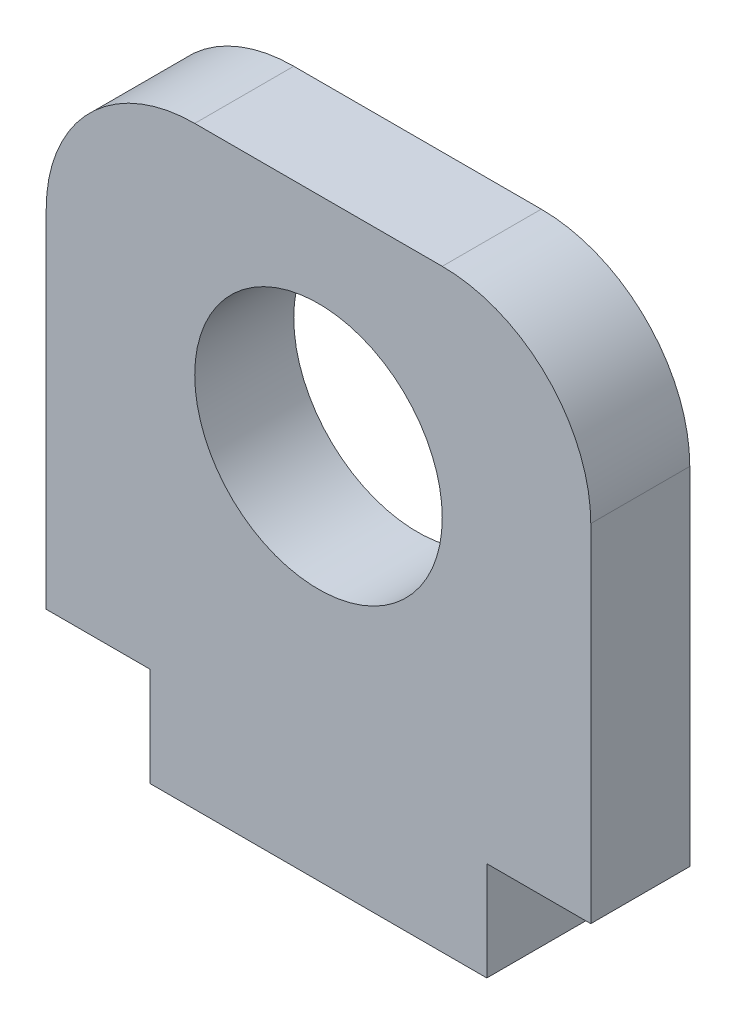
ISO-10303-21;
HEADER;
FILE_DESCRIPTION(('STEP AP214'),'2;1');
FILE_NAME('part.step','',(''),(''),'','','');
FILE_SCHEMA(('AUTOMOTIVE_DESIGN { 1 0 10303 214 1 1 1 1 }'));
ENDSEC;
DATA;
#1=APPLICATION_CONTEXT('core data for automotive mechanical design processes');
#2=APPLICATION_PROTOCOL_DEFINITION('international standard','automotive_design',2000,#1);
#3=PRODUCT_CONTEXT('',#1,'mechanical');
#4=PRODUCT('Part','Part','',(#3));
#5=PRODUCT_RELATED_PRODUCT_CATEGORY('part','',(#4));
#6=PRODUCT_DEFINITION_FORMATION('','',#4);
#7=PRODUCT_DEFINITION_CONTEXT('part definition',#1,'design');
#8=PRODUCT_DEFINITION('design','',#6,#7);
#9=PRODUCT_DEFINITION_SHAPE('','',#8);
#10=(LENGTH_UNIT() NAMED_UNIT(*) SI_UNIT(.MILLI.,.METRE.));
#11=(NAMED_UNIT(*) PLANE_ANGLE_UNIT() SI_UNIT($,.RADIAN.));
#12=(NAMED_UNIT(*) SI_UNIT($,.STERADIAN.) SOLID_ANGLE_UNIT());
#13=UNCERTAINTY_MEASURE_WITH_UNIT(LENGTH_MEASURE(1.E-05),#10,'distance_accuracy_value','');
#14=(GEOMETRIC_REPRESENTATION_CONTEXT(3) GLOBAL_UNCERTAINTY_ASSIGNED_CONTEXT((#13)) GLOBAL_UNIT_ASSIGNED_CONTEXT((#10,
#11,#12)) REPRESENTATION_CONTEXT('',''));
#15=CARTESIAN_POINT('',(0.,0.,0.));
#16=DIRECTION('',(0.,0.,1.));
#17=DIRECTION('',(1.,0.,0.));
#18=AXIS2_PLACEMENT_3D('',#15,#16,#17);
#19=CARTESIAN_POINT('',(-17.0000000000026,-1.99840144432528E-12,5.00000000000456));
#20=DIRECTION('',(-0.999999999999999,0.,0.));
#21=DIRECTION('',(0.,1.00000000000016,0.));
#22=AXIS2_PLACEMENT_3D('',#19,#20,#21);
#23=PLANE('',#22);
#24=DIRECTION('',(0.,0.,1.00000000000016));
#25=VECTOR('',#24,1.);
#26=CARTESIAN_POINT('',(-17.0000000000024,9.99999999999779,5.));
#27=LINE('',#26,#25);
#28=CARTESIAN_POINT('',(-17.0000000000007,10.0000000000021,-4.99999999999945));
#29=VERTEX_POINT('',#28);
#30=CARTESIAN_POINT('',(-17.0000000000024,9.99999999999779,5.));
#31=VERTEX_POINT('',#30);
#32=EDGE_CURVE('E11',#29,#31,#27,.T.);
#33=ORIENTED_EDGE('',*,*,#32,.F.);
#34=DIRECTION('',(0.,1.00000000000016,0.));
#35=VECTOR('',#34,1.);
#36=CARTESIAN_POINT('',(-16.9999999999988,60.0000000000018,-4.99999999999445));
#37=LINE('',#36,#35);
#38=CARTESIAN_POINT('',(-17.0000000000011,1.88737914186277E-12,-4.9999999999949));
#39=VERTEX_POINT('',#38);
#40=EDGE_CURVE('E115',#39,#29,#37,.T.);
#41=ORIENTED_EDGE('',*,*,#40,.F.);
#42=DIRECTION('',(0.,0.,1.00000000000016));
#43=VECTOR('',#42,1.);
#44=CARTESIAN_POINT('',(-17.0000000000026,-1.99840144432528E-12,5.00000000000456));
#45=LINE('',#44,#43);
#46=CARTESIAN_POINT('',(-17.0000000000026,-1.99840144432528E-12,5.00000000000456));
#47=VERTEX_POINT('',#46);
#48=EDGE_CURVE('E51',#39,#47,#45,.T.);
#49=ORIENTED_EDGE('',*,*,#48,.T.);
#50=DIRECTION('',(0.,1.00000000000016,0.));
#51=VECTOR('',#50,1.);
#52=CARTESIAN_POINT('',(-17.0000000000026,-1.99840144432528E-12,5.00000000000456));
#53=LINE('',#52,#51);
#54=EDGE_CURVE('E190',#47,#31,#53,.T.);
#55=ORIENTED_EDGE('',*,*,#54,.T.);
#56=EDGE_LOOP('',(#33,#41,#49,#55));
#57=FACE_BOUND('',#56,.T.);
#58=ADVANCED_FACE('F40',(#57),#23,.T.);
#59=CARTESIAN_POINT('',(-27.500000000002,-1.62092561595273E-11,5.00000000000933));
#60=DIRECTION('',(0.,1.00000000000016,0.));
#61=DIRECTION('',(0.999999999999999,0.,0.));
#62=AXIS2_PLACEMENT_3D('',#59,#60,#61);
#63=PLANE('',#62);
#64=ORIENTED_EDGE('',*,*,#48,.F.);
#65=DIRECTION('',(-0.999999999999999,0.,0.));
#66=VECTOR('',#65,1.);
#67=CARTESIAN_POINT('',(-27.5000000000002,-1.23234755733392E-11,-4.99999999999046));
#68=LINE('',#67,#66);
#69=CARTESIAN_POINT('',(16.9999999999994,1.66533453693773E-12,-5.00000000000322));
#70=VERTEX_POINT('',#69);
#71=EDGE_CURVE('E152',#39,#70,#68,.F.);
#72=ORIENTED_EDGE('',*,*,#71,.T.);
#73=DIRECTION('',(0.,0.,1.00000000000016));
#74=VECTOR('',#73,1.);
#75=CARTESIAN_POINT('',(16.9999999999999,-2.33146835171283E-12,4.99999999999701));
#76=LINE('',#75,#74);
#77=CARTESIAN_POINT('',(16.9999999999999,-2.33146835171283E-12,4.99999999999701));
#78=VERTEX_POINT('',#77);
#79=EDGE_CURVE('E179',#70,#78,#76,.T.);
#80=ORIENTED_EDGE('',*,*,#79,.T.);
#81=DIRECTION('',(0.999999999999999,0.,0.));
#82=VECTOR('',#81,1.);
#83=CARTESIAN_POINT('',(-27.500000000002,-1.62092561595273E-11,5.00000000000933));
#84=LINE('',#83,#82);
#85=EDGE_CURVE('E199',#47,#78,#84,.T.);
#86=ORIENTED_EDGE('',*,*,#85,.F.);
#87=EDGE_LOOP('',(#64,#72,#80,#86));
#88=FACE_BOUND('',#87,.T.);
#89=ADVANCED_FACE('F202',(#88),#63,.F.);
#90=CARTESIAN_POINT('',(16.9999999999999,-2.33146835171283E-12,4.99999999999701));
#91=DIRECTION('',(0.999999999999999,0.,0.));
#92=DIRECTION('',(0.,-1.00000000000016,0.));
#93=AXIS2_PLACEMENT_3D('',#90,#91,#92);
#94=PLANE('',#93);
#95=ORIENTED_EDGE('',*,*,#79,.F.);
#96=DIRECTION('',(0.,1.00000000000016,0.));
#97=VECTOR('',#96,1.);
#98=CARTESIAN_POINT('',(16.9999999999986,60.0000000000019,-5.00000000000278));
#99=LINE('',#98,#97);
#100=CARTESIAN_POINT('',(16.9999999999994,10.0000000000018,-5.));
#101=VERTEX_POINT('',#100);
#102=EDGE_CURVE('E148',#101,#70,#99,.F.);
#103=ORIENTED_EDGE('',*,*,#102,.F.);
#104=DIRECTION('',(0.,0.,1.00000000000016));
#105=VECTOR('',#104,1.);
#106=CARTESIAN_POINT('',(16.9999999999996,9.9999999999979,5.00000000000067));
#107=LINE('',#106,#105);
#108=CARTESIAN_POINT('',(16.9999999999996,9.9999999999979,5.00000000000067));
#109=VERTEX_POINT('',#108);
#110=EDGE_CURVE('E175',#101,#109,#107,.T.);
#111=ORIENTED_EDGE('',*,*,#110,.T.);
#112=DIRECTION('',(0.,-1.00000000000016,0.));
#113=VECTOR('',#112,1.);
#114=CARTESIAN_POINT('',(16.9999999999999,-2.33146835171283E-12,4.99999999999701));
#115=LINE('',#114,#113);
#116=EDGE_CURVE('E204',#109,#78,#115,.T.);
#117=ORIENTED_EDGE('',*,*,#116,.T.);
#118=EDGE_LOOP('',(#95,#103,#111,#117));
#119=FACE_BOUND('',#118,.T.);
#120=ADVANCED_FACE('F259',(#119),#94,.T.);
#121=CARTESIAN_POINT('',(27.4999999999994,9.99999999999768,5.00000000000445));
#122=DIRECTION('',(0.,-1.00000000000016,0.));
#123=DIRECTION('',(-0.999999999999999,0.,0.));
#124=AXIS2_PLACEMENT_3D('',#121,#122,#123);
#125=PLANE('',#124);
#126=ORIENTED_EDGE('',*,*,#110,.F.);
#127=DIRECTION('',(-0.999999999999999,0.,0.));
#128=VECTOR('',#127,1.);
#129=CARTESIAN_POINT('',(-27.5000000000001,9.99999999998824,-4.99999999999023));
#130=LINE('',#129,#128);
#131=CARTESIAN_POINT('',(27.4999999999994,10.0000000000022,-4.99999999999434));
#132=VERTEX_POINT('',#131);
#133=EDGE_CURVE('E144',#132,#101,#130,.T.);
#134=ORIENTED_EDGE('',*,*,#133,.F.);
#135=DIRECTION('',(0.,0.,1.00000000000016));
#136=VECTOR('',#135,1.);
#137=CARTESIAN_POINT('',(27.4999999999994,9.99999999999768,5.00000000000445));
#138=LINE('',#137,#136);
#139=CARTESIAN_POINT('',(27.4999999999994,9.99999999999768,5.00000000000445));
#140=VERTEX_POINT('',#139);
#141=EDGE_CURVE('E171',#132,#140,#138,.T.);
#142=ORIENTED_EDGE('',*,*,#141,.T.);
#143=DIRECTION('',(-0.999999999999999,0.,0.));
#144=VECTOR('',#143,1.);
#145=CARTESIAN_POINT('',(27.4999999999994,9.99999999999768,5.00000000000445));
#146=LINE('',#145,#144);
#147=EDGE_CURVE('E208',#140,#109,#146,.T.);
#148=ORIENTED_EDGE('',*,*,#147,.T.);
#149=EDGE_LOOP('',(#126,#134,#142,#148));
#150=FACE_BOUND('',#149,.T.);
#151=ADVANCED_FACE('F251',(#150),#125,.T.);
#152=CARTESIAN_POINT('',(27.4999999999992,59.9999999999979,5.00000000000045));
#153=DIRECTION('',(0.999999999999999,0.,0.));
#154=DIRECTION('',(0.,-1.00000000000016,0.));
#155=AXIS2_PLACEMENT_3D('',#152,#153,#154);
#156=PLANE('',#155);
#157=ORIENTED_EDGE('',*,*,#141,.F.);
#158=DIRECTION('',(0.,1.00000000000016,0.));
#159=VECTOR('',#158,1.);
#160=CARTESIAN_POINT('',(27.4999999999987,60.0000000000017,-4.99999999999889));
#161=LINE('',#160,#159);
#162=CARTESIAN_POINT('',(27.4999999999996,45.0000000000021,-4.99999999999479));
#163=VERTEX_POINT('',#162);
#164=EDGE_CURVE('E140',#163,#132,#161,.F.);
#165=ORIENTED_EDGE('',*,*,#164,.F.);
#166=DIRECTION('',(0.,0.,1.00000000000016));
#167=VECTOR('',#166,1.);
#168=CARTESIAN_POINT('',(27.4999999999997,44.999999999998,5.00000000000489));
#169=LINE('',#168,#167);
#170=CARTESIAN_POINT('',(27.4999999999997,44.999999999998,5.00000000000489));
#171=VERTEX_POINT('',#170);
#172=EDGE_CURVE('E167',#163,#171,#169,.T.);
#173=ORIENTED_EDGE('',*,*,#172,.T.);
#174=DIRECTION('',(0.,-1.00000000000016,0.));
#175=VECTOR('',#174,1.);
#176=CARTESIAN_POINT('',(27.4999999999992,59.9999999999979,5.00000000000045));
#177=LINE('',#176,#175);
#178=EDGE_CURVE('E215',#171,#140,#177,.T.);
#179=ORIENTED_EDGE('',*,*,#178,.T.);
#180=EDGE_LOOP('',(#157,#165,#173,#179));
#181=FACE_BOUND('',#180,.T.);
#182=ADVANCED_FACE('F244',(#181),#156,.T.);
#183=CARTESIAN_POINT('',(12.500000000001,44.9999999999976,5.00000000000123));
#184=DIRECTION('',(0.,0.,-1.00000000000016));
#185=DIRECTION('',(-0.999999999999999,0.,0.));
#186=AXIS2_PLACEMENT_3D('',#183,#184,#185);
#187=CYLINDRICAL_SURFACE('',#186,15.);
#188=ORIENTED_EDGE('',*,*,#172,.F.);
#189=CARTESIAN_POINT('',(12.5000000000003,45.0000000000019,-5.00000000000311));
#190=DIRECTION('',(0.,0.,-1.00000000000016));
#191=DIRECTION('',(-0.999999999999999,0.,0.));
#192=AXIS2_PLACEMENT_3D('',#189,#190,#191);
#193=CIRCLE('',#192,15.);
#194=CARTESIAN_POINT('',(12.4999999999988,60.0000000000018,-4.99999999999978));
#195=VERTEX_POINT('',#194);
#196=EDGE_CURVE('E136',#163,#195,#193,.F.);
#197=ORIENTED_EDGE('',*,*,#196,.T.);
#198=DIRECTION('',(0.,0.,1.00000000000016));
#199=VECTOR('',#198,1.);
#200=CARTESIAN_POINT('',(12.5000000000012,59.9999999999977,5.00000000000467));
#201=LINE('',#200,#199);
#202=CARTESIAN_POINT('',(12.5000000000012,59.9999999999977,5.00000000000467));
#203=VERTEX_POINT('',#202);
#204=EDGE_CURVE('E163',#195,#203,#201,.T.);
#205=ORIENTED_EDGE('',*,*,#204,.T.);
#206=CARTESIAN_POINT('',(12.500000000001,44.9999999999976,5.00000000000123));
#207=DIRECTION('',(0.,0.,-1.00000000000016));
#208=DIRECTION('',(-0.999999999999999,0.,0.));
#209=AXIS2_PLACEMENT_3D('',#206,#207,#208);
#210=CIRCLE('',#209,15.);
#211=EDGE_CURVE('E219',#171,#203,#210,.F.);
#212=ORIENTED_EDGE('',*,*,#211,.F.);
#213=EDGE_LOOP('',(#188,#197,#205,#212));
#214=FACE_BOUND('',#213,.T.);
#215=ADVANCED_FACE('F239',(#214),#187,.T.);
#216=CARTESIAN_POINT('',(-27.4999999999999,59.9999999999836,5.00000000000433));
#217=DIRECTION('',(0.,1.00000000000016,0.));
#218=DIRECTION('',(0.999999999999999,0.,0.));
#219=AXIS2_PLACEMENT_3D('',#216,#217,#218);
#220=PLANE('',#219);
#221=ORIENTED_EDGE('',*,*,#204,.F.);
#222=DIRECTION('',(-0.999999999999999,0.,0.));
#223=VECTOR('',#222,1.);
#224=CARTESIAN_POINT('',(-27.4999999999977,59.9999999999883,-4.99999999999523));
#225=LINE('',#224,#223);
#226=CARTESIAN_POINT('',(-12.4999999999987,60.0000000000019,-5.00000000000012));
#227=VERTEX_POINT('',#226);
#228=EDGE_CURVE('E132',#227,#195,#225,.F.);
#229=ORIENTED_EDGE('',*,*,#228,.F.);
#230=DIRECTION('',(0.,0.,1.00000000000016));
#231=VECTOR('',#230,1.);
#232=CARTESIAN_POINT('',(-12.5000000000003,59.9999999999978,5.00000000000445));
#233=LINE('',#232,#231);
#234=CARTESIAN_POINT('',(-12.5000000000003,59.9999999999978,5.00000000000445));
#235=VERTEX_POINT('',#234);
#236=EDGE_CURVE('E160',#227,#235,#233,.T.);
#237=ORIENTED_EDGE('',*,*,#236,.T.);
#238=DIRECTION('',(0.999999999999999,0.,0.));
#239=VECTOR('',#238,1.);
#240=CARTESIAN_POINT('',(-27.4999999999999,59.9999999999836,5.00000000000433));
#241=LINE('',#240,#239);
#242=EDGE_CURVE('E223',#235,#203,#241,.T.);
#243=ORIENTED_EDGE('',*,*,#242,.T.);
#244=EDGE_LOOP('',(#221,#229,#237,#243));
#245=FACE_BOUND('',#244,.T.);
#246=ADVANCED_FACE('F235',(#245),#220,.T.);
#247=CARTESIAN_POINT('',(-12.4999999999992,44.999999999998,5.00000000000445));
#248=DIRECTION('',(0.,0.,-1.00000000000016));
#249=DIRECTION('',(-0.999999999999999,0.,0.));
#250=AXIS2_PLACEMENT_3D('',#247,#248,#249);
#251=CYLINDRICAL_SURFACE('',#250,15.);
#252=ORIENTED_EDGE('',*,*,#236,.F.);
#253=CARTESIAN_POINT('',(-12.4999999999983,45.0000000000021,-5.));
#254=DIRECTION('',(0.,0.,-1.00000000000016));
#255=DIRECTION('',(-0.999999999999999,0.,0.));
#256=AXIS2_PLACEMENT_3D('',#253,#254,#255);
#257=CIRCLE('',#256,15.);
#258=CARTESIAN_POINT('',(-27.4999999999981,44.9999999999882,-4.99999999999878));
#259=VERTEX_POINT('',#258);
#260=EDGE_CURVE('E128',#227,#259,#257,.F.);
#261=ORIENTED_EDGE('',*,*,#260,.T.);
#262=DIRECTION('',(0.,0.,1.00000000000016));
#263=VECTOR('',#262,1.);
#264=CARTESIAN_POINT('',(-27.5,44.9999999999837,5.00000000000111));
#265=LINE('',#264,#263);
#266=CARTESIAN_POINT('',(-27.5,44.9999999999837,5.00000000000111));
#267=VERTEX_POINT('',#266);
#268=EDGE_CURVE('E59',#259,#267,#265,.T.);
#269=ORIENTED_EDGE('',*,*,#268,.T.);
#270=CARTESIAN_POINT('',(-12.4999999999992,44.999999999998,5.00000000000445));
#271=DIRECTION('',(0.,0.,-1.00000000000016));
#272=DIRECTION('',(-0.999999999999999,0.,0.));
#273=AXIS2_PLACEMENT_3D('',#270,#271,#272);
#274=CIRCLE('',#273,15.);
#275=EDGE_CURVE('E108',#235,#267,#274,.F.);
#276=ORIENTED_EDGE('',*,*,#275,.F.);
#277=EDGE_LOOP('',(#252,#261,#269,#276));
#278=FACE_BOUND('',#277,.T.);
#279=ADVANCED_FACE('F232',(#278),#251,.T.);
#280=CARTESIAN_POINT('',(-27.4999999999999,59.9999999999836,5.00000000000433));
#281=DIRECTION('',(0.999999999999999,0.,0.));
#282=DIRECTION('',(0.,-1.00000000000016,0.));
#283=AXIS2_PLACEMENT_3D('',#280,#281,#282);
#284=PLANE('',#283);
#285=ORIENTED_EDGE('',*,*,#268,.F.);
#286=DIRECTION('',(0.,1.00000000000016,0.));
#287=VECTOR('',#286,1.);
#288=CARTESIAN_POINT('',(-27.4999999999977,59.9999999999883,-4.99999999999523));
#289=LINE('',#288,#287);
#290=CARTESIAN_POINT('',(-27.5000000000001,9.99999999998824,-4.99999999999023));
#291=VERTEX_POINT('',#290);
#292=EDGE_CURVE('E113',#259,#291,#289,.F.);
#293=ORIENTED_EDGE('',*,*,#292,.T.);
#294=DIRECTION('',(0.,0.,1.00000000000016));
#295=VECTOR('',#294,1.);
#296=CARTESIAN_POINT('',(-27.5000000000021,9.99999999998369,5.00000000001022));
#297=LINE('',#296,#295);
#298=CARTESIAN_POINT('',(-27.5000000000021,9.99999999998369,5.00000000001022));
#299=VERTEX_POINT('',#298);
#300=EDGE_CURVE('E44',#291,#299,#297,.T.);
#301=ORIENTED_EDGE('',*,*,#300,.T.);
#302=DIRECTION('',(0.,-1.00000000000016,0.));
#303=VECTOR('',#302,1.);
#304=CARTESIAN_POINT('',(-27.4999999999999,59.9999999999836,5.00000000000433));
#305=LINE('',#304,#303);
#306=EDGE_CURVE('E231',#267,#299,#305,.T.);
#307=ORIENTED_EDGE('',*,*,#306,.F.);
#308=EDGE_LOOP('',(#285,#293,#301,#307));
#309=FACE_BOUND('',#308,.T.);
#310=ADVANCED_FACE('F118',(#309),#284,.F.);
#311=CARTESIAN_POINT('',(5.82867087928207E-13,37.9999999999976,5.00000000000944));
#312=DIRECTION('',(0.,0.,-1.00000000000016));
#313=DIRECTION('',(-0.999999999999999,0.,0.));
#314=AXIS2_PLACEMENT_3D('',#311,#312,#313);
#315=CYLINDRICAL_SURFACE('',#314,12.5);
#316=CARTESIAN_POINT('',(5.82867087928207E-13,37.9999999999976,5.00000000000944));
#317=DIRECTION('',(0.,0.,1.00000000000016));
#318=DIRECTION('',(0.999999999999999,0.,0.));
#319=AXIS2_PLACEMENT_3D('',#316,#317,#318);
#320=CIRCLE('',#319,12.5);
#321=CARTESIAN_POINT('',(12.5000000000006,37.9999999999976,5.00000000000944));
#322=VERTEX_POINT('',#321);
#323=EDGE_CURVE('E131',#322,#322,#320,.T.);
#324=ORIENTED_EDGE('',*,*,#323,.T.);
#325=EDGE_LOOP('',(#324));
#326=FACE_BOUND('',#325,.T.);
#327=CARTESIAN_POINT('',(-1.20736753927986E-12,38.0000000000019,-4.99999999999012));
#328=DIRECTION('',(0.,0.,1.00000000000016));
#329=DIRECTION('',(0.999999999999999,0.,0.));
#330=AXIS2_PLACEMENT_3D('',#327,#328,#329);
#331=CIRCLE('',#330,12.5);
#332=CARTESIAN_POINT('',(12.4999999999988,38.0000000000019,-4.99999999999012));
#333=VERTEX_POINT('',#332);
#334=EDGE_CURVE('E120',#333,#333,#331,.T.);
#335=ORIENTED_EDGE('',*,*,#334,.F.);
#336=EDGE_LOOP('',(#335));
#337=FACE_BOUND('',#336,.T.);
#338=ADVANCED_FACE('F334',(#326,#337),#315,.F.);
#339=CARTESIAN_POINT('',(-27.5000000000021,9.99999999998369,5.00000000001022));
#340=DIRECTION('',(0.,-1.00000000000016,0.));
#341=DIRECTION('',(-0.999999999999999,0.,0.));
#342=AXIS2_PLACEMENT_3D('',#339,#340,#341);
#343=PLANE('',#342);
#344=DIRECTION('',(-0.999999999999999,0.,0.));
#345=VECTOR('',#344,1.);
#346=CARTESIAN_POINT('',(-27.5000000000001,9.99999999998824,-4.99999999999023));
#347=LINE('',#346,#345);
#348=EDGE_CURVE('E101',#29,#291,#347,.T.);
#349=ORIENTED_EDGE('',*,*,#348,.F.);
#350=ORIENTED_EDGE('',*,*,#32,.T.);
#351=DIRECTION('',(-0.999999999999999,0.,0.));
#352=VECTOR('',#351,1.);
#353=CARTESIAN_POINT('',(-27.5000000000021,9.99999999998369,5.00000000001022));
#354=LINE('',#353,#352);
#355=EDGE_CURVE('E103',#31,#299,#354,.T.);
#356=ORIENTED_EDGE('',*,*,#355,.T.);
#357=ORIENTED_EDGE('',*,*,#300,.F.);
#358=EDGE_LOOP('',(#349,#350,#356,#357));
#359=FACE_BOUND('',#358,.T.);
#360=ADVANCED_FACE('F42',(#359),#343,.T.);
#361=CARTESIAN_POINT('',(-27.4999999999999,59.9999999999836,5.00000000000433));
#362=DIRECTION('',(0.,0.,-1.00000000000016));
#363=DIRECTION('',(-0.999999999999999,0.,0.));
#364=AXIS2_PLACEMENT_3D('',#361,#362,#363);
#365=PLANE('',#364);
#366=ORIENTED_EDGE('',*,*,#323,.F.);
#367=EDGE_LOOP('',(#366));
#368=FACE_BOUND('',#367,.T.);
#369=ORIENTED_EDGE('',*,*,#306,.T.);
#370=ORIENTED_EDGE('',*,*,#355,.F.);
#371=ORIENTED_EDGE('',*,*,#54,.F.);
#372=ORIENTED_EDGE('',*,*,#85,.T.);
#373=ORIENTED_EDGE('',*,*,#116,.F.);
#374=ORIENTED_EDGE('',*,*,#147,.F.);
#375=ORIENTED_EDGE('',*,*,#178,.F.);
#376=ORIENTED_EDGE('',*,*,#211,.T.);
#377=ORIENTED_EDGE('',*,*,#242,.F.);
#378=ORIENTED_EDGE('',*,*,#275,.T.);
#379=EDGE_LOOP('',(#369,#370,#371,#372,#373,#374,#375,#376,#377,#378));
#380=FACE_BOUND('',#379,.T.);
#381=ADVANCED_FACE('F197',(#368,#380),#365,.F.);
#382=CARTESIAN_POINT('',(-27.4999999999977,59.9999999999883,-4.99999999999523));
#383=DIRECTION('',(0.,0.,-1.00000000000016));
#384=DIRECTION('',(-0.999999999999999,0.,0.));
#385=AXIS2_PLACEMENT_3D('',#382,#383,#384);
#386=PLANE('',#385);
#387=ORIENTED_EDGE('',*,*,#334,.T.);
#388=EDGE_LOOP('',(#387));
#389=FACE_BOUND('',#388,.T.);
#390=ORIENTED_EDGE('',*,*,#292,.F.);
#391=ORIENTED_EDGE('',*,*,#260,.F.);
#392=ORIENTED_EDGE('',*,*,#228,.T.);
#393=ORIENTED_EDGE('',*,*,#196,.F.);
#394=ORIENTED_EDGE('',*,*,#164,.T.);
#395=ORIENTED_EDGE('',*,*,#133,.T.);
#396=ORIENTED_EDGE('',*,*,#102,.T.);
#397=ORIENTED_EDGE('',*,*,#71,.F.);
#398=ORIENTED_EDGE('',*,*,#40,.T.);
#399=ORIENTED_EDGE('',*,*,#348,.T.);
#400=EDGE_LOOP('',(#390,#391,#392,#393,#394,#395,#396,#397,#398,#399));
#401=FACE_BOUND('',#400,.T.);
#402=ADVANCED_FACE('F111',(#389,#401),#386,.T.);
#403=CLOSED_SHELL('',(#58,#89,#120,#151,#182,#215,#246,#279,#310,#338,#360,#381,#402));
#404=MANIFOLD_SOLID_BREP('B2',#403);
#405=ADVANCED_BREP_SHAPE_REPRESENTATION('',(#18,#404),#14);
#406=SHAPE_DEFINITION_REPRESENTATION(#9,#405);
ENDSEC;
END-ISO-10303-21;
